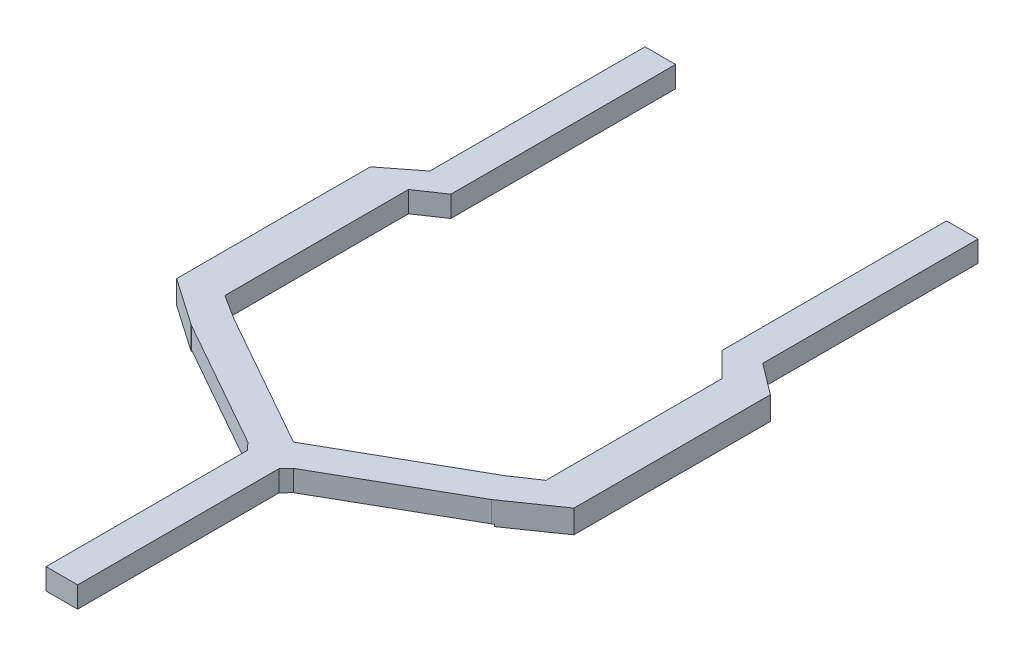
ISO-10303-21;
HEADER;
FILE_DESCRIPTION(('STEP AP214'),'2;1');
FILE_NAME('part.step','',(''),(''),'','','');
FILE_SCHEMA(('AUTOMOTIVE_DESIGN { 1 0 10303 214 1 1 1 1 }'));
ENDSEC;
DATA;
#1=APPLICATION_CONTEXT('core data for automotive mechanical design processes');
#2=APPLICATION_PROTOCOL_DEFINITION('international standard','automotive_design',2000,#1);
#3=PRODUCT_CONTEXT('',#1,'mechanical');
#4=PRODUCT('Part','Part','',(#3));
#5=PRODUCT_RELATED_PRODUCT_CATEGORY('part','',(#4));
#6=PRODUCT_DEFINITION_FORMATION('','',#4);
#7=PRODUCT_DEFINITION_CONTEXT('part definition',#1,'design');
#8=PRODUCT_DEFINITION('design','',#6,#7);
#9=PRODUCT_DEFINITION_SHAPE('','',#8);
#10=(LENGTH_UNIT() NAMED_UNIT(*) SI_UNIT(.MILLI.,.METRE.));
#11=(NAMED_UNIT(*) PLANE_ANGLE_UNIT() SI_UNIT($,.RADIAN.));
#12=(NAMED_UNIT(*) SI_UNIT($,.STERADIAN.) SOLID_ANGLE_UNIT());
#13=UNCERTAINTY_MEASURE_WITH_UNIT(LENGTH_MEASURE(1.E-05),#10,'distance_accuracy_value','');
#14=(GEOMETRIC_REPRESENTATION_CONTEXT(3) GLOBAL_UNCERTAINTY_ASSIGNED_CONTEXT((#13)) GLOBAL_UNIT_ASSIGNED_CONTEXT((#10,
#11,#12)) REPRESENTATION_CONTEXT('',''));
#15=CARTESIAN_POINT('',(0.,0.,0.));
#16=DIRECTION('',(0.,0.,1.));
#17=DIRECTION('',(1.,0.,0.));
#18=AXIS2_PLACEMENT_3D('',#15,#16,#17);
#19=CARTESIAN_POINT('',(20.066,2.54,0.));
#20=DIRECTION('',(1.,0.,0.));
#21=DIRECTION('',(0.,0.,-1.));
#22=AXIS2_PLACEMENT_3D('',#19,#20,#21);
#23=PLANE('',#22);
#24=DIRECTION('',(0.,0.,1.));
#25=VECTOR('',#24,1.);
#26=CARTESIAN_POINT('',(20.066,2.54,0.));
#27=LINE('',#26,#25);
#28=CARTESIAN_POINT('',(20.066,2.54,-90.3578767457702));
#29=VERTEX_POINT('',#28);
#30=CARTESIAN_POINT('',(20.066,2.54,-64.4164306863508));
#31=VERTEX_POINT('',#30);
#32=EDGE_CURVE('E329',#29,#31,#27,.T.);
#33=ORIENTED_EDGE('',*,*,#32,.T.);
#34=DIRECTION('',(0.,1.,0.));
#35=VECTOR('',#34,1.);
#36=CARTESIAN_POINT('',(20.066,-0.254000000000001,-64.4164306863508));
#37=LINE('',#36,#35);
#38=CARTESIAN_POINT('',(20.066,0.,-64.4164306863508));
#39=VERTEX_POINT('',#38);
#40=EDGE_CURVE('E276',#39,#31,#37,.T.);
#41=ORIENTED_EDGE('',*,*,#40,.F.);
#42=DIRECTION('',(0.,0.,1.));
#43=VECTOR('',#42,1.);
#44=CARTESIAN_POINT('',(20.066,0.,0.));
#45=LINE('',#44,#43);
#46=CARTESIAN_POINT('',(20.066,0.,-90.3578767457702));
#47=VERTEX_POINT('',#46);
#48=EDGE_CURVE('E375',#47,#39,#45,.T.);
#49=ORIENTED_EDGE('',*,*,#48,.F.);
#50=DIRECTION('',(0.,-1.,0.));
#51=VECTOR('',#50,1.);
#52=CARTESIAN_POINT('',(20.066,2.54,-90.3578767457702));
#53=LINE('',#52,#51);
#54=EDGE_CURVE('E418',#29,#47,#53,.T.);
#55=ORIENTED_EDGE('',*,*,#54,.F.);
#56=EDGE_LOOP('',(#33,#41,#49,#55));
#57=FACE_BOUND('',#56,.T.);
#58=ADVANCED_FACE('F35',(#57),#23,.T.);
#59=CARTESIAN_POINT('',(-0.137151710877593,2.54,0.073424146501728));
#60=DIRECTION('',(0.881613677056408,0.,-0.471971741131903));
#61=DIRECTION('',(-0.471971741131903,0.,-0.881613677056408));
#62=AXIS2_PLACEMENT_3D('',#59,#60,#61);
#63=PLANE('',#62);
#64=DIRECTION('',(0.,1.,0.));
#65=VECTOR('',#64,1.);
#66=CARTESIAN_POINT('',(-18.3853046553877,-0.254000000000001,-34.012983608155));
#67=LINE('',#66,#65);
#68=CARTESIAN_POINT('',(-18.3853046553877,0.,-34.012983608155));
#69=VERTEX_POINT('',#68);
#70=CARTESIAN_POINT('',(-18.3853046553877,2.54,-34.012983608155));
#71=VERTEX_POINT('',#70);
#72=EDGE_CURVE('E293',#69,#71,#67,.T.);
#73=ORIENTED_EDGE('',*,*,#72,.F.);
#74=DIRECTION('',(0.471971741131903,0.,0.881613677056408));
#75=VECTOR('',#74,1.);
#76=CARTESIAN_POINT('',(-0.137151710877593,0.,0.073424146501728));
#77=LINE('',#76,#75);
#78=CARTESIAN_POINT('',(-18.3592347962972,0.,-33.9642867427918));
#79=VERTEX_POINT('',#78);
#80=EDGE_CURVE('E399',#69,#79,#77,.T.);
#81=ORIENTED_EDGE('',*,*,#80,.T.);
#82=DIRECTION('',(0.,-1.,0.));
#83=VECTOR('',#82,1.);
#84=CARTESIAN_POINT('',(-18.3592347962972,2.54,-33.9642867427918));
#85=LINE('',#84,#83);
#86=CARTESIAN_POINT('',(-18.3592347962972,2.54,-33.9642867427918));
#87=VERTEX_POINT('',#86);
#88=EDGE_CURVE('E353',#87,#79,#85,.T.);
#89=ORIENTED_EDGE('',*,*,#88,.F.);
#90=DIRECTION('',(0.471971741131903,0.,0.881613677056408));
#91=VECTOR('',#90,1.);
#92=CARTESIAN_POINT('',(-0.137151710877593,2.54,0.073424146501728));
#93=LINE('',#92,#91);
#94=EDGE_CURVE('E351',#71,#87,#93,.T.);
#95=ORIENTED_EDGE('',*,*,#94,.F.);
#96=EDGE_LOOP('',(#73,#81,#89,#95));
#97=FACE_BOUND('',#96,.T.);
#98=ADVANCED_FACE('F546',(#97),#63,.F.);
#99=CARTESIAN_POINT('',(10.1014604239502,2.54,-17.9300922525116));
#100=DIRECTION('',(0.490843733940776,0.,-0.871247627744878));
#101=DIRECTION('',(-0.871247627744878,0.,-0.490843733940776));
#102=AXIS2_PLACEMENT_3D('',#99,#100,#101);
#103=PLANE('',#102);
#104=DIRECTION('',(0.871247627744878,0.,0.490843733940776));
#105=VECTOR('',#104,1.);
#106=CARTESIAN_POINT('',(10.1014604239502,0.,-17.9300922525116));
#107=LINE('',#106,#105);
#108=CARTESIAN_POINT('',(-2.74838844255943,0.,-25.1694437266015));
#109=VERTEX_POINT('',#108);
#110=EDGE_CURVE('E302',#79,#109,#107,.T.);
#111=ORIENTED_EDGE('',*,*,#110,.T.);
#112=DIRECTION('',(0.,-1.,0.));
#113=VECTOR('',#112,1.);
#114=CARTESIAN_POINT('',(-2.74838844255943,2.54,-25.1694437266015));
#115=LINE('',#114,#113);
#116=CARTESIAN_POINT('',(-2.74838844255943,2.54,-25.1694437266015));
#117=VERTEX_POINT('',#116);
#118=EDGE_CURVE('E432',#117,#109,#115,.T.);
#119=ORIENTED_EDGE('',*,*,#118,.F.);
#120=DIRECTION('',(0.871247627744878,0.,0.490843733940776));
#121=VECTOR('',#120,1.);
#122=CARTESIAN_POINT('',(10.1014604239502,2.54,-17.9300922525116));
#123=LINE('',#122,#121);
#124=EDGE_CURVE('E310',#87,#117,#123,.T.);
#125=ORIENTED_EDGE('',*,*,#124,.F.);
#126=ORIENTED_EDGE('',*,*,#88,.T.);
#127=EDGE_LOOP('',(#111,#119,#125,#126));
#128=FACE_BOUND('',#127,.T.);
#129=ADVANCED_FACE('F37',(#128),#103,.F.);
#130=CARTESIAN_POINT('',(11.1419283860614,2.54,-10.6846405459769));
#131=DIRECTION('',(0.721762966631555,0.,-0.69214031814309));
#132=DIRECTION('',(-0.69214031814309,0.,-0.721762966631555));
#133=AXIS2_PLACEMENT_3D('',#130,#131,#132);
#134=PLANE('',#133);
#135=DIRECTION('',(0.69214031814309,0.,0.721762966631555));
#136=VECTOR('',#135,1.);
#137=CARTESIAN_POINT('',(11.1419283860614,0.,-10.6846405459769));
#138=LINE('',#137,#136);
#139=CARTESIAN_POINT('',(-1.905,0.,-24.2899594249825));
#140=VERTEX_POINT('',#139);
#141=EDGE_CURVE('E356',#109,#140,#138,.T.);
#142=ORIENTED_EDGE('',*,*,#141,.T.);
#143=DIRECTION('',(0.,-1.,0.));
#144=VECTOR('',#143,1.);
#145=CARTESIAN_POINT('',(-1.905,2.54,-24.2899594249825));
#146=LINE('',#145,#144);
#147=CARTESIAN_POINT('',(-1.905,2.54,-24.2899594249825));
#148=VERTEX_POINT('',#147);
#149=EDGE_CURVE('E430',#148,#140,#146,.T.);
#150=ORIENTED_EDGE('',*,*,#149,.F.);
#151=DIRECTION('',(0.69214031814309,0.,0.721762966631555));
#152=VECTOR('',#151,1.);
#153=CARTESIAN_POINT('',(11.1419283860614,2.54,-10.6846405459769));
#154=LINE('',#153,#152);
#155=EDGE_CURVE('E313',#117,#148,#154,.T.);
#156=ORIENTED_EDGE('',*,*,#155,.F.);
#157=ORIENTED_EDGE('',*,*,#118,.T.);
#158=EDGE_LOOP('',(#142,#150,#156,#157));
#159=FACE_BOUND('',#158,.T.);
#160=ADVANCED_FACE('F660',(#159),#134,.F.);
#161=CARTESIAN_POINT('',(-1.905,2.54,0.));
#162=DIRECTION('',(-1.,0.,0.));
#163=DIRECTION('',(0.,0.,1.));
#164=AXIS2_PLACEMENT_3D('',#161,#162,#163);
#165=PLANE('',#164);
#166=DIRECTION('',(0.,0.,-1.));
#167=VECTOR('',#166,1.);
#168=CARTESIAN_POINT('',(-1.905,0.,0.));
#169=LINE('',#168,#167);
#170=CARTESIAN_POINT('',(-1.905,0.,0.));
#171=VERTEX_POINT('',#170);
#172=EDGE_CURVE('E359',#171,#140,#169,.T.);
#173=ORIENTED_EDGE('',*,*,#172,.F.);
#174=DIRECTION('',(0.,-1.,0.));
#175=VECTOR('',#174,1.);
#176=CARTESIAN_POINT('',(-1.905,2.54,0.));
#177=LINE('',#176,#175);
#178=CARTESIAN_POINT('',(-1.905,2.54,0.));
#179=VERTEX_POINT('',#178);
#180=EDGE_CURVE('E428',#179,#171,#177,.T.);
#181=ORIENTED_EDGE('',*,*,#180,.F.);
#182=DIRECTION('',(0.,0.,-1.));
#183=VECTOR('',#182,1.);
#184=CARTESIAN_POINT('',(-1.905,2.54,0.));
#185=LINE('',#184,#183);
#186=EDGE_CURVE('E316',#179,#148,#185,.T.);
#187=ORIENTED_EDGE('',*,*,#186,.T.);
#188=ORIENTED_EDGE('',*,*,#149,.T.);
#189=EDGE_LOOP('',(#173,#181,#187,#188));
#190=FACE_BOUND('',#189,.T.);
#191=ADVANCED_FACE('F657',(#190),#165,.T.);
#192=CARTESIAN_POINT('',(0.,2.54,0.));
#193=DIRECTION('',(0.,0.,1.));
#194=DIRECTION('',(1.,0.,0.));
#195=AXIS2_PLACEMENT_3D('',#192,#193,#194);
#196=PLANE('',#195);
#197=DIRECTION('',(-1.,0.,0.));
#198=VECTOR('',#197,1.);
#199=CARTESIAN_POINT('',(0.,0.,0.));
#200=LINE('',#199,#198);
#201=CARTESIAN_POINT('',(1.905,0.,0.));
#202=VERTEX_POINT('',#201);
#203=EDGE_CURVE('E362',#202,#171,#200,.T.);
#204=ORIENTED_EDGE('',*,*,#203,.F.);
#205=DIRECTION('',(0.,-1.,0.));
#206=VECTOR('',#205,1.);
#207=CARTESIAN_POINT('',(1.905,2.54,0.));
#208=LINE('',#207,#206);
#209=CARTESIAN_POINT('',(1.905,2.54,0.));
#210=VERTEX_POINT('',#209);
#211=EDGE_CURVE('E426',#210,#202,#208,.T.);
#212=ORIENTED_EDGE('',*,*,#211,.F.);
#213=DIRECTION('',(-1.,0.,0.));
#214=VECTOR('',#213,1.);
#215=CARTESIAN_POINT('',(0.,2.54,0.));
#216=LINE('',#215,#214);
#217=EDGE_CURVE('E319',#210,#179,#216,.T.);
#218=ORIENTED_EDGE('',*,*,#217,.T.);
#219=ORIENTED_EDGE('',*,*,#180,.T.);
#220=EDGE_LOOP('',(#204,#212,#218,#219));
#221=FACE_BOUND('',#220,.T.);
#222=ADVANCED_FACE('F653',(#221),#196,.T.);
#223=CARTESIAN_POINT('',(1.905,2.54,0.));
#224=DIRECTION('',(-1.,0.,0.));
#225=DIRECTION('',(0.,0.,1.));
#226=AXIS2_PLACEMENT_3D('',#223,#224,#225);
#227=PLANE('',#226);
#228=DIRECTION('',(0.,0.,-1.));
#229=VECTOR('',#228,1.);
#230=CARTESIAN_POINT('',(1.905,0.,0.));
#231=LINE('',#230,#229);
#232=CARTESIAN_POINT('',(1.905,0.,-24.2899594249825));
#233=VERTEX_POINT('',#232);
#234=EDGE_CURVE('E365',#202,#233,#231,.T.);
#235=ORIENTED_EDGE('',*,*,#234,.T.);
#236=DIRECTION('',(0.,-1.,0.));
#237=VECTOR('',#236,1.);
#238=CARTESIAN_POINT('',(1.905,2.54,-24.2899594249825));
#239=LINE('',#238,#237);
#240=CARTESIAN_POINT('',(1.905,2.54,-24.2899594249825));
#241=VERTEX_POINT('',#240);
#242=EDGE_CURVE('E423',#241,#233,#239,.T.);
#243=ORIENTED_EDGE('',*,*,#242,.F.);
#244=DIRECTION('',(0.,0.,-1.));
#245=VECTOR('',#244,1.);
#246=CARTESIAN_POINT('',(1.905,2.54,0.));
#247=LINE('',#246,#245);
#248=EDGE_CURVE('E322',#210,#241,#247,.T.);
#249=ORIENTED_EDGE('',*,*,#248,.F.);
#250=ORIENTED_EDGE('',*,*,#211,.T.);
#251=EDGE_LOOP('',(#235,#243,#249,#250));
#252=FACE_BOUND('',#251,.T.);
#253=ADVANCED_FACE('F650',(#252),#227,.F.);
#254=CARTESIAN_POINT('',(-11.1419283860616,2.54,-10.6846405459784));
#255=DIRECTION('',(-0.721762966631511,0.,-0.692140318143136));
#256=DIRECTION('',(-0.692140318143136,0.,0.721762966631511));
#257=AXIS2_PLACEMENT_3D('',#254,#255,#256);
#258=PLANE('',#257);
#259=DIRECTION('',(0.692140318143136,0.,-0.721762966631511));
#260=VECTOR('',#259,1.);
#261=CARTESIAN_POINT('',(-11.1419283860616,0.,-10.6846405459784));
#262=LINE('',#261,#260);
#263=CARTESIAN_POINT('',(2.74838844255953,0.,-25.1694437266015));
#264=VERTEX_POINT('',#263);
#265=EDGE_CURVE('E367',#233,#264,#262,.T.);
#266=ORIENTED_EDGE('',*,*,#265,.T.);
#267=DIRECTION('',(0.,-1.,0.));
#268=VECTOR('',#267,1.);
#269=CARTESIAN_POINT('',(2.74838844255953,2.54,-25.1694437266015));
#270=LINE('',#269,#268);
#271=CARTESIAN_POINT('',(2.74838844255953,2.54,-25.1694437266015));
#272=VERTEX_POINT('',#271);
#273=EDGE_CURVE('E420',#272,#264,#270,.T.);
#274=ORIENTED_EDGE('',*,*,#273,.F.);
#275=DIRECTION('',(0.692140318143136,0.,-0.721762966631511));
#276=VECTOR('',#275,1.);
#277=CARTESIAN_POINT('',(-11.1419283860616,2.54,-10.6846405459784));
#278=LINE('',#277,#276);
#279=EDGE_CURVE('E324',#241,#272,#278,.T.);
#280=ORIENTED_EDGE('',*,*,#279,.F.);
#281=ORIENTED_EDGE('',*,*,#242,.T.);
#282=EDGE_LOOP('',(#266,#274,#280,#281));
#283=FACE_BOUND('',#282,.T.);
#284=ADVANCED_FACE('F522',(#283),#258,.F.);
#285=CARTESIAN_POINT('',(-10.1656955271368,2.54,-17.7899671724893));
#286=DIRECTION('',(0.496138938356834,0.,0.868243142124459));
#287=DIRECTION('',(0.868243142124459,0.,-0.496138938356834));
#288=AXIS2_PLACEMENT_3D('',#285,#286,#287);
#289=PLANE('',#288);
#290=DIRECTION('',(0.,1.,0.));
#291=VECTOR('',#290,1.);
#292=CARTESIAN_POINT('',(17.9469765299134,-0.254000000000001,-33.8543512050894));
#293=LINE('',#292,#291);
#294=CARTESIAN_POINT('',(17.9469765299134,0.,-33.8543512050894));
#295=VERTEX_POINT('',#294);
#296=CARTESIAN_POINT('',(17.9469765299134,2.54,-33.8543512050894));
#297=VERTEX_POINT('',#296);
#298=EDGE_CURVE('E278',#295,#297,#293,.T.);
#299=ORIENTED_EDGE('',*,*,#298,.T.);
#300=DIRECTION('',(-0.868243142124459,0.,0.496138938356834));
#301=VECTOR('',#300,1.);
#302=CARTESIAN_POINT('',(-10.1656955271368,2.54,-17.7899671724893));
#303=LINE('',#302,#301);
#304=EDGE_CURVE('E327',#297,#272,#303,.T.);
#305=ORIENTED_EDGE('',*,*,#304,.T.);
#306=ORIENTED_EDGE('',*,*,#273,.T.);
#307=DIRECTION('',(-0.868243142124459,0.,0.496138938356834));
#308=VECTOR('',#307,1.);
#309=CARTESIAN_POINT('',(-10.1656955271368,0.,-17.7899671724893));
#310=LINE('',#309,#308);
#311=EDGE_CURVE('E370',#295,#264,#310,.T.);
#312=ORIENTED_EDGE('',*,*,#311,.F.);
#313=EDGE_LOOP('',(#299,#305,#306,#312));
#314=FACE_BOUND('',#313,.T.);
#315=ADVANCED_FACE('F510',(#314),#289,.T.);
#316=CARTESIAN_POINT('',(0.,2.54,-90.3578767457702));
#317=DIRECTION('',(0.,0.,-1.));
#318=DIRECTION('',(-1.,0.,0.));
#319=AXIS2_PLACEMENT_3D('',#316,#317,#318);
#320=PLANE('',#319);
#321=DIRECTION('',(1.,0.,0.));
#322=VECTOR('',#321,1.);
#323=CARTESIAN_POINT('',(0.,0.,-90.3578767457702));
#324=LINE('',#323,#322);
#325=CARTESIAN_POINT('',(16.2704595799521,0.,-90.3578767457702));
#326=VERTEX_POINT('',#325);
#327=EDGE_CURVE('E378',#326,#47,#324,.T.);
#328=ORIENTED_EDGE('',*,*,#327,.F.);
#329=DIRECTION('',(0.,-1.,0.));
#330=VECTOR('',#329,1.);
#331=CARTESIAN_POINT('',(16.2704595799521,2.54,-90.3578767457702));
#332=LINE('',#331,#330);
#333=CARTESIAN_POINT('',(16.2704595799521,2.54,-90.3578767457702));
#334=VERTEX_POINT('',#333);
#335=EDGE_CURVE('E416',#334,#326,#332,.T.);
#336=ORIENTED_EDGE('',*,*,#335,.F.);
#337=DIRECTION('',(1.,0.,0.));
#338=VECTOR('',#337,1.);
#339=CARTESIAN_POINT('',(0.,2.54,-90.3578767457702));
#340=LINE('',#339,#338);
#341=EDGE_CURVE('E332',#334,#29,#340,.T.);
#342=ORIENTED_EDGE('',*,*,#341,.T.);
#343=ORIENTED_EDGE('',*,*,#54,.T.);
#344=EDGE_LOOP('',(#328,#336,#342,#343));
#345=FACE_BOUND('',#344,.T.);
#346=ADVANCED_FACE('F612',(#345),#320,.T.);
#347=CARTESIAN_POINT('',(16.2704595799521,2.54,0.));
#348=DIRECTION('',(1.,0.,0.));
#349=DIRECTION('',(0.,0.,-1.));
#350=AXIS2_PLACEMENT_3D('',#347,#348,#349);
#351=PLANE('',#350);
#352=DIRECTION('',(0.,0.,1.));
#353=VECTOR('',#352,1.);
#354=CARTESIAN_POINT('',(16.2704595799521,0.,0.));
#355=LINE('',#354,#353);
#356=CARTESIAN_POINT('',(16.2704595799521,0.,-63.2891356107421));
#357=VERTEX_POINT('',#356);
#358=EDGE_CURVE('E381',#326,#357,#355,.T.);
#359=ORIENTED_EDGE('',*,*,#358,.T.);
#360=DIRECTION('',(0.,1.,0.));
#361=VECTOR('',#360,1.);
#362=CARTESIAN_POINT('',(16.2704595799521,2.54,-63.2891356107421));
#363=LINE('',#362,#361);
#364=CARTESIAN_POINT('',(16.2704595799521,2.54,-63.2891356107421));
#365=VERTEX_POINT('',#364);
#366=EDGE_CURVE('E484',#357,#365,#363,.T.);
#367=ORIENTED_EDGE('',*,*,#366,.T.);
#368=DIRECTION('',(0.,0.,1.));
#369=VECTOR('',#368,1.);
#370=CARTESIAN_POINT('',(16.2704595799521,2.54,0.));
#371=LINE('',#370,#369);
#372=EDGE_CURVE('E335',#334,#365,#371,.T.);
#373=ORIENTED_EDGE('',*,*,#372,.F.);
#374=ORIENTED_EDGE('',*,*,#335,.T.);
#375=EDGE_LOOP('',(#359,#367,#373,#374));
#376=FACE_BOUND('',#375,.T.);
#377=ADVANCED_FACE('F608',(#376),#351,.F.);
#378=CARTESIAN_POINT('',(-11.9846163510707,2.54,-21.1157526185533));
#379=DIRECTION('',(0.493605519458381,0.,0.869685915236197));
#380=DIRECTION('',(0.869685915236197,0.,-0.493605519458381));
#381=AXIS2_PLACEMENT_3D('',#378,#379,#380);
#382=PLANE('',#381);
#383=DIRECTION('',(-0.869685915236197,0.,0.493605519458381));
#384=VECTOR('',#383,1.);
#385=CARTESIAN_POINT('',(-11.9846163510707,0.,-21.1157526185533));
#386=LINE('',#385,#384);
#387=CARTESIAN_POINT('',(16.2704595799521,0.,-37.1524173361608));
#388=VERTEX_POINT('',#387);
#389=CARTESIAN_POINT('',(0.,0.,-27.917832169161));
#390=VERTEX_POINT('',#389);
#391=EDGE_CURVE('E384',#388,#390,#386,.T.);
#392=ORIENTED_EDGE('',*,*,#391,.T.);
#393=DIRECTION('',(0.,-1.,0.));
#394=VECTOR('',#393,1.);
#395=CARTESIAN_POINT('',(0.,2.54,-27.917832169161));
#396=LINE('',#395,#394);
#397=CARTESIAN_POINT('',(0.,2.54,-27.917832169161));
#398=VERTEX_POINT('',#397);
#399=EDGE_CURVE('E411',#398,#390,#396,.T.);
#400=ORIENTED_EDGE('',*,*,#399,.F.);
#401=DIRECTION('',(-0.869685915236197,0.,0.493605519458381));
#402=VECTOR('',#401,1.);
#403=CARTESIAN_POINT('',(-11.9846163510707,2.54,-21.1157526185533));
#404=LINE('',#403,#402);
#405=CARTESIAN_POINT('',(16.2704595799521,2.54,-37.1524173361608));
#406=VERTEX_POINT('',#405);
#407=EDGE_CURVE('E338',#406,#398,#404,.T.);
#408=ORIENTED_EDGE('',*,*,#407,.F.);
#409=DIRECTION('',(0.,-1.,0.));
#410=VECTOR('',#409,1.);
#411=CARTESIAN_POINT('',(16.2704595799521,2.54,-37.1524173361608));
#412=LINE('',#411,#410);
#413=EDGE_CURVE('E413',#406,#388,#412,.T.);
#414=ORIENTED_EDGE('',*,*,#413,.T.);
#415=EDGE_LOOP('',(#392,#400,#408,#414));
#416=FACE_BOUND('',#415,.T.);
#417=ADVANCED_FACE('F593',(#416),#382,.F.);
#418=CARTESIAN_POINT('',(11.9431106206795,2.54,-21.1848033628718));
#419=DIRECTION('',(0.491093730974849,0.,-0.871106737086336));
#420=DIRECTION('',(-0.871106737086336,0.,-0.491093730974849));
#421=AXIS2_PLACEMENT_3D('',#418,#419,#420);
#422=PLANE('',#421);
#423=DIRECTION('',(0.871106737086336,0.,0.491093730974849));
#424=VECTOR('',#423,1.);
#425=CARTESIAN_POINT('',(11.9431106206795,0.,-21.1848033628718));
#426=LINE('',#425,#424);
#427=CARTESIAN_POINT('',(-16.3803951176544,0.,-37.1524173361608));
#428=VERTEX_POINT('',#427);
#429=EDGE_CURVE('E387',#428,#390,#426,.T.);
#430=ORIENTED_EDGE('',*,*,#429,.F.);
#431=DIRECTION('',(0.,-1.,0.));
#432=VECTOR('',#431,1.);
#433=CARTESIAN_POINT('',(-16.3803951176544,2.54,-37.1524173361608));
#434=LINE('',#433,#432);
#435=CARTESIAN_POINT('',(-16.3803951176544,2.54,-37.1524173361608));
#436=VERTEX_POINT('',#435);
#437=EDGE_CURVE('E409',#436,#428,#434,.T.);
#438=ORIENTED_EDGE('',*,*,#437,.F.);
#439=DIRECTION('',(0.871106737086336,0.,0.491093730974849));
#440=VECTOR('',#439,1.);
#441=CARTESIAN_POINT('',(11.9431106206795,2.54,-21.1848033628718));
#442=LINE('',#441,#440);
#443=EDGE_CURVE('E340',#436,#398,#442,.T.);
#444=ORIENTED_EDGE('',*,*,#443,.T.);
#445=ORIENTED_EDGE('',*,*,#399,.T.);
#446=EDGE_LOOP('',(#430,#438,#444,#445));
#447=FACE_BOUND('',#446,.T.);
#448=ADVANCED_FACE('F589',(#447),#422,.T.);
#449=CARTESIAN_POINT('',(-16.3803951176544,2.54,0.));
#450=DIRECTION('',(1.,0.,0.));
#451=DIRECTION('',(0.,0.,-1.));
#452=AXIS2_PLACEMENT_3D('',#449,#450,#451);
#453=PLANE('',#452);
#454=DIRECTION('',(0.,1.,0.));
#455=VECTOR('',#454,1.);
#456=CARTESIAN_POINT('',(-16.3803951176544,-0.254000000000001,-63.274089715642));
#457=LINE('',#456,#455);
#458=CARTESIAN_POINT('',(-16.3803951176544,0.,-63.274089715642));
#459=VERTEX_POINT('',#458);
#460=CARTESIAN_POINT('',(-16.3803951176544,2.54,-63.274089715642));
#461=VERTEX_POINT('',#460);
#462=EDGE_CURVE('E496',#459,#461,#457,.T.);
#463=ORIENTED_EDGE('',*,*,#462,.F.);
#464=DIRECTION('',(0.,0.,1.));
#465=VECTOR('',#464,1.);
#466=CARTESIAN_POINT('',(-16.3803951176544,0.,0.));
#467=LINE('',#466,#465);
#468=CARTESIAN_POINT('',(-16.3803951176544,0.,-90.3578767457702));
#469=VERTEX_POINT('',#468);
#470=EDGE_CURVE('E390',#469,#459,#467,.T.);
#471=ORIENTED_EDGE('',*,*,#470,.F.);
#472=DIRECTION('',(0.,-1.,0.));
#473=VECTOR('',#472,1.);
#474=CARTESIAN_POINT('',(-16.3803951176544,2.54,-90.3578767457702));
#475=LINE('',#474,#473);
#476=CARTESIAN_POINT('',(-16.3803951176544,2.54,-90.3578767457702));
#477=VERTEX_POINT('',#476);
#478=EDGE_CURVE('E407',#477,#469,#475,.T.);
#479=ORIENTED_EDGE('',*,*,#478,.F.);
#480=DIRECTION('',(0.,0.,1.));
#481=VECTOR('',#480,1.);
#482=CARTESIAN_POINT('',(-16.3803951176544,2.54,0.));
#483=LINE('',#482,#481);
#484=EDGE_CURVE('E343',#477,#461,#483,.T.);
#485=ORIENTED_EDGE('',*,*,#484,.T.);
#486=EDGE_LOOP('',(#463,#471,#479,#485));
#487=FACE_BOUND('',#486,.T.);
#488=ADVANCED_FACE('F574',(#487),#453,.T.);
#489=CARTESIAN_POINT('',(0.,2.54,-90.3578767457702));
#490=DIRECTION('',(0.,0.,1.));
#491=DIRECTION('',(1.,0.,0.));
#492=AXIS2_PLACEMENT_3D('',#489,#490,#491);
#493=PLANE('',#492);
#494=DIRECTION('',(-1.,0.,0.));
#495=VECTOR('',#494,1.);
#496=CARTESIAN_POINT('',(0.,0.,-90.3578767457702));
#497=LINE('',#496,#495);
#498=CARTESIAN_POINT('',(-20.0659999999999,0.,-90.3578767457702));
#499=VERTEX_POINT('',#498);
#500=EDGE_CURVE('E393',#469,#499,#497,.T.);
#501=ORIENTED_EDGE('',*,*,#500,.T.);
#502=DIRECTION('',(0.,-1.,0.));
#503=VECTOR('',#502,1.);
#504=CARTESIAN_POINT('',(-20.0659999999999,2.54,-90.3578767457702));
#505=LINE('',#504,#503);
#506=CARTESIAN_POINT('',(-20.0659999999999,2.54,-90.3578767457702));
#507=VERTEX_POINT('',#506);
#508=EDGE_CURVE('E404',#507,#499,#505,.T.);
#509=ORIENTED_EDGE('',*,*,#508,.F.);
#510=DIRECTION('',(-1.,0.,0.));
#511=VECTOR('',#510,1.);
#512=CARTESIAN_POINT('',(0.,2.54,-90.3578767457702));
#513=LINE('',#512,#511);
#514=EDGE_CURVE('E346',#477,#507,#513,.T.);
#515=ORIENTED_EDGE('',*,*,#514,.F.);
#516=ORIENTED_EDGE('',*,*,#478,.T.);
#517=EDGE_LOOP('',(#501,#509,#515,#516));
#518=FACE_BOUND('',#517,.T.);
#519=ADVANCED_FACE('F569',(#518),#493,.F.);
#520=CARTESIAN_POINT('',(-20.0659999999999,2.54,0.));
#521=DIRECTION('',(1.,0.,0.));
#522=DIRECTION('',(0.,0.,-1.));
#523=AXIS2_PLACEMENT_3D('',#520,#521,#522);
#524=PLANE('',#523);
#525=DIRECTION('',(0.,0.,1.));
#526=VECTOR('',#525,1.);
#527=CARTESIAN_POINT('',(-20.0659999999999,0.,0.));
#528=LINE('',#527,#526);
#529=CARTESIAN_POINT('',(-20.0659999999999,0.,-64.4164306863508));
#530=VERTEX_POINT('',#529);
#531=EDGE_CURVE('E396',#499,#530,#528,.T.);
#532=ORIENTED_EDGE('',*,*,#531,.T.);
#533=DIRECTION('',(0.,1.,0.));
#534=VECTOR('',#533,1.);
#535=CARTESIAN_POINT('',(-20.0659999999999,-0.254000000000001,-64.4164306863508));
#536=LINE('',#535,#534);
#537=CARTESIAN_POINT('',(-20.0659999999999,2.54,-64.4164306863508));
#538=VERTEX_POINT('',#537);
#539=EDGE_CURVE('E303',#530,#538,#536,.T.);
#540=ORIENTED_EDGE('',*,*,#539,.T.);
#541=DIRECTION('',(0.,0.,1.));
#542=VECTOR('',#541,1.);
#543=CARTESIAN_POINT('',(-20.0659999999999,2.54,0.));
#544=LINE('',#543,#542);
#545=EDGE_CURVE('E348',#507,#538,#544,.T.);
#546=ORIENTED_EDGE('',*,*,#545,.F.);
#547=ORIENTED_EDGE('',*,*,#508,.T.);
#548=EDGE_LOOP('',(#532,#540,#546,#547));
#549=FACE_BOUND('',#548,.T.);
#550=ADVANCED_FACE('F563',(#549),#524,.F.);
#551=CARTESIAN_POINT('',(0.,2.54,0.));
#552=DIRECTION('',(0.,1.,0.));
#553=DIRECTION('',(0.,0.,1.));
#554=AXIS2_PLACEMENT_3D('',#551,#552,#553);
#555=PLANE('',#554);
#556=DIRECTION('',(-0.821076360113838,0.,0.570818369415536));
#557=VECTOR('',#556,1.);
#558=CARTESIAN_POINT('',(17.9469765299134,2.54,-33.8543512050894));
#559=LINE('',#558,#557);
#560=CARTESIAN_POINT('',(23.7979137303775,2.54,-37.9219661000775));
#561=VERTEX_POINT('',#560);
#562=EDGE_CURVE('E260',#561,#297,#559,.T.);
#563=ORIENTED_EDGE('',*,*,#562,.F.);
#564=DIRECTION('',(0.,0.,1.));
#565=VECTOR('',#564,1.);
#566=CARTESIAN_POINT('',(23.7979137303775,2.54,0.));
#567=LINE('',#566,#565);
#568=CARTESIAN_POINT('',(23.7979137303775,2.54,-61.6013045377534));
#569=VERTEX_POINT('',#568);
#570=EDGE_CURVE('E499',#569,#561,#567,.T.);
#571=ORIENTED_EDGE('',*,*,#570,.F.);
#572=DIRECTION('',(0.798334419333176,0.,0.602214376204987));
#573=VECTOR('',#572,1.);
#574=CARTESIAN_POINT('',(25.1668186608023,2.54,-60.5686868667675));
#575=LINE('',#574,#573);
#576=EDGE_CURVE('E617',#31,#569,#575,.T.);
#577=ORIENTED_EDGE('',*,*,#576,.F.);
#578=ORIENTED_EDGE('',*,*,#32,.F.);
#579=ORIENTED_EDGE('',*,*,#341,.F.);
#580=ORIENTED_EDGE('',*,*,#372,.T.);
#581=DIRECTION('',(-0.707106781186549,0.,-0.707106781186546));
#582=VECTOR('',#581,1.);
#583=CARTESIAN_POINT('',(19.2107793993315,2.54,-60.3488157913628));
#584=LINE('',#583,#582);
#585=CARTESIAN_POINT('',(19.2107793993315,2.54,-60.3488157913628));
#586=VERTEX_POINT('',#585);
#587=EDGE_CURVE('E479',#586,#365,#584,.T.);
#588=ORIENTED_EDGE('',*,*,#587,.F.);
#589=DIRECTION('',(0.,0.,-1.));
#590=VECTOR('',#589,1.);
#591=CARTESIAN_POINT('',(19.2107793993315,2.54,-39.1312570148036));
#592=LINE('',#591,#590);
#593=CARTESIAN_POINT('',(19.2107793993315,2.54,-39.1312570148036));
#594=VERTEX_POINT('',#593);
#595=EDGE_CURVE('E472',#594,#586,#592,.T.);
#596=ORIENTED_EDGE('',*,*,#595,.F.);
#597=DIRECTION('',(0.829616727470738,0.,-0.558333310398675));
#598=VECTOR('',#597,1.);
#599=CARTESIAN_POINT('',(16.2704595799521,2.54,-37.1524173361608));
#600=LINE('',#599,#598);
#601=EDGE_CURVE('E468',#406,#594,#600,.T.);
#602=ORIENTED_EDGE('',*,*,#601,.F.);
#603=ORIENTED_EDGE('',*,*,#407,.T.);
#604=ORIENTED_EDGE('',*,*,#443,.F.);
#605=DIRECTION('',(0.845017912644893,0.,0.534737998751975));
#606=VECTOR('',#605,1.);
#607=CARTESIAN_POINT('',(-16.3803951176544,2.54,-37.1524173361608));
#608=LINE('',#607,#606);
#609=CARTESIAN_POINT('',(-19.4252628213139,2.54,-39.0792480434805));
#610=VERTEX_POINT('',#609);
#611=EDGE_CURVE('E494',#610,#436,#608,.T.);
#612=ORIENTED_EDGE('',*,*,#611,.F.);
#613=DIRECTION('',(0.,0.,1.));
#614=VECTOR('',#613,1.);
#615=CARTESIAN_POINT('',(-19.4252628213139,2.54,-39.0792480434805));
#616=LINE('',#615,#614);
#617=CARTESIAN_POINT('',(-19.4252628213139,2.54,-61.216281016721));
#618=VERTEX_POINT('',#617);
#619=EDGE_CURVE('E491',#618,#610,#616,.T.);
#620=ORIENTED_EDGE('',*,*,#619,.F.);
#621=DIRECTION('',(-0.828530185204564,0.,0.559944400994322));
#622=VECTOR('',#621,1.);
#623=CARTESIAN_POINT('',(-19.4252628213139,2.54,-61.216281016721));
#624=LINE('',#623,#622);
#625=EDGE_CURVE('E488',#461,#618,#624,.T.);
#626=ORIENTED_EDGE('',*,*,#625,.F.);
#627=ORIENTED_EDGE('',*,*,#484,.F.);
#628=ORIENTED_EDGE('',*,*,#514,.T.);
#629=ORIENTED_EDGE('',*,*,#545,.T.);
#630=DIRECTION('',(0.788359831352413,0.,-0.615214414907514));
#631=VECTOR('',#630,1.);
#632=CARTESIAN_POINT('',(-25.9827794418144,2.54,-59.7991381028509));
#633=LINE('',#632,#631);
#634=CARTESIAN_POINT('',(-24.0937698938882,2.54,-61.2732694037677));
#635=VERTEX_POINT('',#634);
#636=EDGE_CURVE('E532',#635,#538,#633,.T.);
#637=ORIENTED_EDGE('',*,*,#636,.F.);
#638=DIRECTION('',(0.,0.,1.));
#639=VECTOR('',#638,1.);
#640=CARTESIAN_POINT('',(-24.0937698938882,2.54,0.));
#641=LINE('',#640,#639);
#642=CARTESIAN_POINT('',(-24.0937698938882,2.54,-37.933647844426));
#643=VERTEX_POINT('',#642);
#644=EDGE_CURVE('E294',#635,#643,#641,.T.);
#645=ORIENTED_EDGE('',*,*,#644,.T.);
#646=DIRECTION('',(-0.822239272628296,0.,-0.569141966953493));
#647=VECTOR('',#646,1.);
#648=CARTESIAN_POINT('',(-18.3592347962972,2.54,-33.9642867427918));
#649=LINE('',#648,#647);
#650=CARTESIAN_POINT('',(-18.4295871468185,2.54,-34.012983608155));
#651=VERTEX_POINT('',#650);
#652=EDGE_CURVE('E530',#651,#643,#649,.T.);
#653=ORIENTED_EDGE('',*,*,#652,.F.);
#654=DIRECTION('',(-1.,0.,0.));
#655=VECTOR('',#654,1.);
#656=CARTESIAN_POINT('',(0.,2.54,-34.012983608155));
#657=LINE('',#656,#655);
#658=EDGE_CURVE('E286',#71,#651,#657,.T.);
#659=ORIENTED_EDGE('',*,*,#658,.F.);
#660=ORIENTED_EDGE('',*,*,#94,.T.);
#661=ORIENTED_EDGE('',*,*,#124,.T.);
#662=ORIENTED_EDGE('',*,*,#155,.T.);
#663=ORIENTED_EDGE('',*,*,#186,.F.);
#664=ORIENTED_EDGE('',*,*,#217,.F.);
#665=ORIENTED_EDGE('',*,*,#248,.T.);
#666=ORIENTED_EDGE('',*,*,#279,.T.);
#667=ORIENTED_EDGE('',*,*,#304,.F.);
#668=EDGE_LOOP('',(#563,#571,#577,#578,#579,#580,#588,#596,#602,#603,#604,#612,#620,#626,#627,
#628,#629,#637,#645,#653,#659,#660,#661,#662,#663,#664,#665,#666,#667));
#669=FACE_BOUND('',#668,.T.);
#670=ADVANCED_FACE('F514',(#669),#555,.T.);
#671=CARTESIAN_POINT('',(0.,0.,0.));
#672=DIRECTION('',(0.,1.,0.));
#673=DIRECTION('',(0.,0.,1.));
#674=AXIS2_PLACEMENT_3D('',#671,#672,#673);
#675=PLANE('',#674);
#676=DIRECTION('',(-0.517208865247926,0.,0.855859211382896));
#677=VECTOR('',#676,1.);
#678=CARTESIAN_POINT('',(-1.7475692320106,0.,-1.05608292509925));
#679=LINE('',#678,#677);
#680=CARTESIAN_POINT('',(20.066,0.,-37.1524173361608));
#681=VERTEX_POINT('',#680);
#682=CARTESIAN_POINT('',(18.1641808441331,0.,-34.0053532537366));
#683=VERTEX_POINT('',#682);
#684=EDGE_CURVE('E372',#681,#683,#679,.T.);
#685=ORIENTED_EDGE('',*,*,#684,.T.);
#686=DIRECTION('',(-0.821076360113838,0.,0.570818369415536));
#687=VECTOR('',#686,1.);
#688=CARTESIAN_POINT('',(-10.0193143069984,0.,-14.4119785956608));
#689=LINE('',#688,#687);
#690=EDGE_CURVE('E528',#683,#295,#689,.T.);
#691=ORIENTED_EDGE('',*,*,#690,.T.);
#692=ORIENTED_EDGE('',*,*,#311,.T.);
#693=ORIENTED_EDGE('',*,*,#265,.F.);
#694=ORIENTED_EDGE('',*,*,#234,.F.);
#695=ORIENTED_EDGE('',*,*,#203,.T.);
#696=ORIENTED_EDGE('',*,*,#172,.T.);
#697=ORIENTED_EDGE('',*,*,#141,.F.);
#698=ORIENTED_EDGE('',*,*,#110,.F.);
#699=ORIENTED_EDGE('',*,*,#80,.F.);
#700=CARTESIAN_POINT('',(-20.0659999999999,0.,-37.1524173361608));
#701=VERTEX_POINT('',#700);
#702=EDGE_CURVE('E314',#701,#69,#77,.T.);
#703=ORIENTED_EDGE('',*,*,#702,.F.);
#704=EDGE_CURVE('E395',#530,#701,#528,.T.);
#705=ORIENTED_EDGE('',*,*,#704,.F.);
#706=ORIENTED_EDGE('',*,*,#531,.F.);
#707=ORIENTED_EDGE('',*,*,#500,.F.);
#708=ORIENTED_EDGE('',*,*,#470,.T.);
#709=DIRECTION('',(-0.828530185204564,0.,0.559944400994322));
#710=VECTOR('',#709,1.);
#711=CARTESIAN_POINT('',(-34.490673419731,0.,-51.0346455568356));
#712=LINE('',#711,#710);
#713=CARTESIAN_POINT('',(-19.4252628213139,0.,-61.216281016721));
#714=VERTEX_POINT('',#713);
#715=EDGE_CURVE('E435',#459,#714,#712,.T.);
#716=ORIENTED_EDGE('',*,*,#715,.T.);
#717=DIRECTION('',(0.,0.,1.));
#718=VECTOR('',#717,1.);
#719=CARTESIAN_POINT('',(-19.4252628213139,0.,0.));
#720=LINE('',#719,#718);
#721=CARTESIAN_POINT('',(-19.4252628213139,0.,-39.0792480434805));
#722=VERTEX_POINT('',#721);
#723=EDGE_CURVE('E438',#714,#722,#720,.T.);
#724=ORIENTED_EDGE('',*,*,#723,.T.);
#725=DIRECTION('',(0.845017912644893,0.,0.534737998751975));
#726=VECTOR('',#725,1.);
#727=CARTESIAN_POINT('',(12.1039221063549,0.,-19.127181941436));
#728=LINE('',#727,#726);
#729=EDGE_CURVE('E441',#722,#428,#728,.T.);
#730=ORIENTED_EDGE('',*,*,#729,.T.);
#731=ORIENTED_EDGE('',*,*,#429,.T.);
#732=ORIENTED_EDGE('',*,*,#391,.F.);
#733=DIRECTION('',(0.829616727470738,0.,-0.558333310398675));
#734=VECTOR('',#733,1.);
#735=CARTESIAN_POINT('',(-12.1370089268457,0.,-18.03414813274));
#736=LINE('',#735,#734);
#737=CARTESIAN_POINT('',(19.2107793993315,0.,-39.1312570148036));
#738=VERTEX_POINT('',#737);
#739=EDGE_CURVE('E444',#388,#738,#736,.T.);
#740=ORIENTED_EDGE('',*,*,#739,.T.);
#741=DIRECTION('',(0.,0.,-1.));
#742=VECTOR('',#741,1.);
#743=CARTESIAN_POINT('',(19.2107793993315,0.,0.));
#744=LINE('',#743,#742);
#745=CARTESIAN_POINT('',(19.2107793993315,0.,-60.3488157913628));
#746=VERTEX_POINT('',#745);
#747=EDGE_CURVE('E447',#738,#746,#744,.T.);
#748=ORIENTED_EDGE('',*,*,#747,.T.);
#749=DIRECTION('',(-0.707106781186549,0.,-0.707106781186546));
#750=VECTOR('',#749,1.);
#751=CARTESIAN_POINT('',(39.7797975953471,0.,-39.7797975953472));
#752=LINE('',#751,#750);
#753=EDGE_CURVE('E450',#746,#357,#752,.T.);
#754=ORIENTED_EDGE('',*,*,#753,.T.);
#755=ORIENTED_EDGE('',*,*,#358,.F.);
#756=ORIENTED_EDGE('',*,*,#327,.T.);
#757=ORIENTED_EDGE('',*,*,#48,.T.);
#758=EDGE_CURVE('E273',#39,#681,#45,.T.);
#759=ORIENTED_EDGE('',*,*,#758,.T.);
#760=EDGE_LOOP('',(#685,#691,#692,#693,#694,#695,#696,#697,#698,#699,#703,#705,#706,#707,#708,
#716,#724,#730,#731,#732,#740,#748,#754,#755,#756,#757,#759));
#761=FACE_BOUND('',#760,.T.);
#762=ADVANCED_FACE('F526',(#761),#675,.F.);
#763=CARTESIAN_POINT('',(-20.0659999999999,-0.254000000000001,0.));
#764=DIRECTION('',(-1.,0.,0.));
#765=DIRECTION('',(0.,0.,1.));
#766=AXIS2_PLACEMENT_3D('',#763,#764,#765);
#767=PLANE('',#766);
#768=CARTESIAN_POINT('',(-20.0659999999999,-0.254000000000001,-64.4164306863508));
#769=VERTEX_POINT('',#768);
#770=EDGE_CURVE('E299',#769,#530,#536,.T.);
#771=ORIENTED_EDGE('',*,*,#770,.T.);
#772=ORIENTED_EDGE('',*,*,#704,.T.);
#773=DIRECTION('',(0.,1.,0.));
#774=VECTOR('',#773,1.);
#775=CARTESIAN_POINT('',(-20.0659999999999,-0.254000000000001,-37.1524173361608));
#776=LINE('',#775,#774);
#777=CARTESIAN_POINT('',(-20.0659999999999,-0.254000000000001,-37.1524173361608));
#778=VERTEX_POINT('',#777);
#779=EDGE_CURVE('E304',#778,#701,#776,.T.);
#780=ORIENTED_EDGE('',*,*,#779,.F.);
#781=DIRECTION('',(0.,0.,1.));
#782=VECTOR('',#781,1.);
#783=CARTESIAN_POINT('',(-20.0659999999999,-0.254000000000001,0.));
#784=LINE('',#783,#782);
#785=EDGE_CURVE('E291',#769,#778,#784,.T.);
#786=ORIENTED_EDGE('',*,*,#785,.F.);
#787=EDGE_LOOP('',(#771,#772,#780,#786));
#788=FACE_BOUND('',#787,.T.);
#789=ADVANCED_FACE('F557',(#788),#767,.F.);
#790=CARTESIAN_POINT('',(-0.137151710877593,-0.254000000000001,0.073424146501728));
#791=DIRECTION('',(-0.881613677056408,0.,0.471971741131903));
#792=DIRECTION('',(0.471971741131903,0.,0.881613677056408));
#793=AXIS2_PLACEMENT_3D('',#790,#791,#792);
#794=PLANE('',#793);
#795=ORIENTED_EDGE('',*,*,#779,.T.);
#796=ORIENTED_EDGE('',*,*,#702,.T.);
#797=CARTESIAN_POINT('',(-18.3853046553877,-0.254000000000001,-34.012983608155));
#798=VERTEX_POINT('',#797);
#799=EDGE_CURVE('E307',#798,#69,#67,.T.);
#800=ORIENTED_EDGE('',*,*,#799,.F.);
#801=DIRECTION('',(0.471971741131903,0.,0.881613677056408));
#802=VECTOR('',#801,1.);
#803=CARTESIAN_POINT('',(-0.137151710877593,-0.254000000000001,0.073424146501728));
#804=LINE('',#803,#802);
#805=EDGE_CURVE('E289',#778,#798,#804,.T.);
#806=ORIENTED_EDGE('',*,*,#805,.F.);
#807=EDGE_LOOP('',(#795,#796,#800,#806));
#808=FACE_BOUND('',#807,.T.);
#809=ADVANCED_FACE('F549',(#808),#794,.F.);
#810=CARTESIAN_POINT('',(0.,-0.254000000000001,-34.012983608155));
#811=DIRECTION('',(0.,0.,-1.));
#812=DIRECTION('',(-1.,0.,0.));
#813=AXIS2_PLACEMENT_3D('',#810,#811,#812);
#814=PLANE('',#813);
#815=ORIENTED_EDGE('',*,*,#658,.T.);
#816=DIRECTION('',(0.,-1.,0.));
#817=VECTOR('',#816,1.);
#818=CARTESIAN_POINT('',(-18.4295871468185,-0.254000000000001,-34.012983608155));
#819=LINE('',#818,#817);
#820=CARTESIAN_POINT('',(-18.4295871468185,-0.254000000000001,-34.012983608155));
#821=VERTEX_POINT('',#820);
#822=EDGE_CURVE('E469',#651,#821,#819,.T.);
#823=ORIENTED_EDGE('',*,*,#822,.T.);
#824=DIRECTION('',(-1.,0.,0.));
#825=VECTOR('',#824,1.);
#826=CARTESIAN_POINT('',(0.,-0.254000000000001,-34.012983608155));
#827=LINE('',#826,#825);
#828=EDGE_CURVE('E285',#798,#821,#827,.T.);
#829=ORIENTED_EDGE('',*,*,#828,.F.);
#830=ORIENTED_EDGE('',*,*,#799,.T.);
#831=ORIENTED_EDGE('',*,*,#72,.T.);
#832=EDGE_LOOP('',(#815,#823,#829,#830,#831));
#833=FACE_BOUND('',#832,.T.);
#834=ADVANCED_FACE('F542',(#833),#814,.F.);
#835=CARTESIAN_POINT('',(-24.0937698938882,-0.254000000000001,0.));
#836=DIRECTION('',(-1.,0.,0.));
#837=DIRECTION('',(0.,0.,1.));
#838=AXIS2_PLACEMENT_3D('',#835,#836,#837);
#839=PLANE('',#838);
#840=DIRECTION('',(0.,1.,0.));
#841=VECTOR('',#840,1.);
#842=CARTESIAN_POINT('',(-24.0937698938882,-0.254000000000001,-61.2732694037677));
#843=LINE('',#842,#841);
#844=CARTESIAN_POINT('',(-24.0937698938882,-0.254000000000001,-61.2732694037677));
#845=VERTEX_POINT('',#844);
#846=EDGE_CURVE('E465',#845,#635,#843,.T.);
#847=ORIENTED_EDGE('',*,*,#846,.F.);
#848=DIRECTION('',(0.,0.,1.));
#849=VECTOR('',#848,1.);
#850=CARTESIAN_POINT('',(-24.0937698938882,-0.254000000000001,0.));
#851=LINE('',#850,#849);
#852=CARTESIAN_POINT('',(-24.0937698938882,-0.254000000000001,-37.933647844426));
#853=VERTEX_POINT('',#852);
#854=EDGE_CURVE('E282',#845,#853,#851,.T.);
#855=ORIENTED_EDGE('',*,*,#854,.T.);
#856=DIRECTION('',(0.,-1.,0.));
#857=VECTOR('',#856,1.);
#858=CARTESIAN_POINT('',(-24.0937698938882,-0.254000000000001,-37.933647844426));
#859=LINE('',#858,#857);
#860=EDGE_CURVE('E464',#643,#853,#859,.T.);
#861=ORIENTED_EDGE('',*,*,#860,.F.);
#862=ORIENTED_EDGE('',*,*,#644,.F.);
#863=EDGE_LOOP('',(#847,#855,#861,#862));
#864=FACE_BOUND('',#863,.T.);
#865=ADVANCED_FACE('F462',(#864),#839,.T.);
#866=CARTESIAN_POINT('',(0.,-0.254000000000001,0.));
#867=DIRECTION('',(0.,1.,0.));
#868=DIRECTION('',(0.,0.,1.));
#869=AXIS2_PLACEMENT_3D('',#866,#867,#868);
#870=PLANE('',#869);
#871=ORIENTED_EDGE('',*,*,#854,.F.);
#872=DIRECTION('',(0.788359831352413,0.,-0.615214414907514));
#873=VECTOR('',#872,1.);
#874=CARTESIAN_POINT('',(-38.8373902434893,-0.254000000000001,-49.7677519911947));
#875=LINE('',#874,#873);
#876=EDGE_CURVE('E11',#845,#769,#875,.T.);
#877=ORIENTED_EDGE('',*,*,#876,.T.);
#878=ORIENTED_EDGE('',*,*,#785,.T.);
#879=ORIENTED_EDGE('',*,*,#805,.T.);
#880=ORIENTED_EDGE('',*,*,#828,.T.);
#881=DIRECTION('',(-0.822239272628296,0.,-0.569141966953493));
#882=VECTOR('',#881,1.);
#883=CARTESIAN_POINT('',(9.9473263759498,-0.254000000000001,-14.3709001951451));
#884=LINE('',#883,#882);
#885=EDGE_CURVE('E43',#821,#853,#884,.T.);
#886=ORIENTED_EDGE('',*,*,#885,.T.);
#887=EDGE_LOOP('',(#871,#877,#878,#879,#880,#886));
#888=FACE_BOUND('',#887,.T.);
#889=ADVANCED_FACE('F455',(#888),#870,.F.);
#890=CARTESIAN_POINT('',(-1.7475692320106,-0.254000000000001,-1.05608292509925));
#891=DIRECTION('',(0.855859211382896,0.,0.517208865247926));
#892=DIRECTION('',(0.517208865247926,0.,-0.855859211382896));
#893=AXIS2_PLACEMENT_3D('',#890,#891,#892);
#894=PLANE('',#893);
#895=DIRECTION('',(0.517208865247926,0.,-0.855859211382896));
#896=VECTOR('',#895,1.);
#897=CARTESIAN_POINT('',(-1.7475692320106,-0.254000000000001,-1.05608292509925));
#898=LINE('',#897,#896);
#899=CARTESIAN_POINT('',(18.1641808441331,-0.254000000000001,-34.0053532537365));
#900=VERTEX_POINT('',#899);
#901=CARTESIAN_POINT('',(20.066,-0.254000000000001,-37.1524173361608));
#902=VERTEX_POINT('',#901);
#903=EDGE_CURVE('E266',#900,#902,#898,.T.);
#904=ORIENTED_EDGE('',*,*,#903,.F.);
#905=DIRECTION('',(0.,1.,0.));
#906=VECTOR('',#905,1.);
#907=CARTESIAN_POINT('',(18.1641808441331,-0.254000000000001,-34.0053532537366));
#908=LINE('',#907,#906);
#909=EDGE_CURVE('E50',#900,#683,#908,.T.);
#910=ORIENTED_EDGE('',*,*,#909,.T.);
#911=ORIENTED_EDGE('',*,*,#684,.F.);
#912=DIRECTION('',(0.,1.,0.));
#913=VECTOR('',#912,1.);
#914=CARTESIAN_POINT('',(20.066,-0.254000000000001,-37.1524173361608));
#915=LINE('',#914,#913);
#916=EDGE_CURVE('E275',#902,#681,#915,.T.);
#917=ORIENTED_EDGE('',*,*,#916,.F.);
#918=EDGE_LOOP('',(#904,#910,#911,#917));
#919=FACE_BOUND('',#918,.T.);
#920=ADVANCED_FACE('F627',(#919),#894,.F.);
#921=CARTESIAN_POINT('',(20.066,-0.254000000000001,0.));
#922=DIRECTION('',(1.,0.,0.));
#923=DIRECTION('',(0.,0.,-1.));
#924=AXIS2_PLACEMENT_3D('',#921,#922,#923);
#925=PLANE('',#924);
#926=ORIENTED_EDGE('',*,*,#916,.T.);
#927=ORIENTED_EDGE('',*,*,#758,.F.);
#928=CARTESIAN_POINT('',(20.066,-0.254000000000001,-64.4164306863508));
#929=VERTEX_POINT('',#928);
#930=EDGE_CURVE('E254',#929,#39,#37,.T.);
#931=ORIENTED_EDGE('',*,*,#930,.F.);
#932=DIRECTION('',(0.,0.,-1.));
#933=VECTOR('',#932,1.);
#934=CARTESIAN_POINT('',(20.066,-0.254000000000001,0.));
#935=LINE('',#934,#933);
#936=EDGE_CURVE('E263',#902,#929,#935,.T.);
#937=ORIENTED_EDGE('',*,*,#936,.F.);
#938=EDGE_LOOP('',(#926,#927,#931,#937));
#939=FACE_BOUND('',#938,.T.);
#940=ADVANCED_FACE('F271',(#939),#925,.F.);
#941=CARTESIAN_POINT('',(23.7979137303775,-0.254000000000001,0.));
#942=DIRECTION('',(-1.,0.,0.));
#943=DIRECTION('',(0.,0.,1.));
#944=AXIS2_PLACEMENT_3D('',#941,#942,#943);
#945=PLANE('',#944);
#946=ORIENTED_EDGE('',*,*,#570,.T.);
#947=DIRECTION('',(0.,1.,0.));
#948=VECTOR('',#947,1.);
#949=CARTESIAN_POINT('',(23.7979137303775,-0.254000000000001,-37.9219661000775));
#950=LINE('',#949,#948);
#951=CARTESIAN_POINT('',(23.7979137303775,-0.254000000000001,-37.9219661000775));
#952=VERTEX_POINT('',#951);
#953=EDGE_CURVE('E622',#952,#561,#950,.T.);
#954=ORIENTED_EDGE('',*,*,#953,.F.);
#955=DIRECTION('',(0.,0.,1.));
#956=VECTOR('',#955,1.);
#957=CARTESIAN_POINT('',(23.7979137303775,-0.254000000000001,0.));
#958=LINE('',#957,#956);
#959=CARTESIAN_POINT('',(23.7979137303775,-0.254000000000001,-61.6013045377534));
#960=VERTEX_POINT('',#959);
#961=EDGE_CURVE('E269',#960,#952,#958,.T.);
#962=ORIENTED_EDGE('',*,*,#961,.F.);
#963=DIRECTION('',(0.,1.,0.));
#964=VECTOR('',#963,1.);
#965=CARTESIAN_POINT('',(23.7979137303775,-0.254000000000001,-61.6013045377534));
#966=LINE('',#965,#964);
#967=EDGE_CURVE('E58',#960,#569,#966,.T.);
#968=ORIENTED_EDGE('',*,*,#967,.T.);
#969=EDGE_LOOP('',(#946,#954,#962,#968));
#970=FACE_BOUND('',#969,.T.);
#971=ADVANCED_FACE('F624',(#970),#945,.F.);
#972=CARTESIAN_POINT('',(0.,-0.254000000000001,0.));
#973=DIRECTION('',(0.,1.,0.));
#974=DIRECTION('',(0.,0.,1.));
#975=AXIS2_PLACEMENT_3D('',#972,#973,#974);
#976=PLANE('',#975);
#977=ORIENTED_EDGE('',*,*,#961,.T.);
#978=DIRECTION('',(-0.821076360113838,0.,0.570818369415536));
#979=VECTOR('',#978,1.);
#980=CARTESIAN_POINT('',(17.9469765299134,-0.254000000000001,-33.8543512050894));
#981=LINE('',#980,#979);
#982=EDGE_CURVE('E259',#952,#900,#981,.T.);
#983=ORIENTED_EDGE('',*,*,#982,.T.);
#984=ORIENTED_EDGE('',*,*,#903,.T.);
#985=ORIENTED_EDGE('',*,*,#936,.T.);
#986=DIRECTION('',(0.798334419333176,0.,0.602214376204987));
#987=VECTOR('',#986,1.);
#988=CARTESIAN_POINT('',(25.1668186608023,-0.254000000000001,-60.5686868667675));
#989=LINE('',#988,#987);
#990=EDGE_CURVE('E250',#929,#960,#989,.T.);
#991=ORIENTED_EDGE('',*,*,#990,.T.);
#992=EDGE_LOOP('',(#977,#983,#984,#985,#991));
#993=FACE_BOUND('',#992,.T.);
#994=ADVANCED_FACE('F264',(#993),#976,.F.);
#995=CARTESIAN_POINT('',(-16.3803951176544,-0.254000000000001,-37.1524173361608));
#996=DIRECTION('',(-0.534737998751975,0.,0.845017912644893));
#997=DIRECTION('',(0.845017912644893,0.,0.534737998751975));
#998=AXIS2_PLACEMENT_3D('',#995,#996,#997);
#999=PLANE('',#998);
#1000=DIRECTION('',(0.,1.,0.));
#1001=VECTOR('',#1000,1.);
#1002=CARTESIAN_POINT('',(-19.4252628213139,-0.254000000000001,-39.0792480434805));
#1003=LINE('',#1002,#1001);
#1004=EDGE_CURVE('E497',#722,#610,#1003,.T.);
#1005=ORIENTED_EDGE('',*,*,#1004,.T.);
#1006=ORIENTED_EDGE('',*,*,#611,.T.);
#1007=ORIENTED_EDGE('',*,*,#437,.T.);
#1008=ORIENTED_EDGE('',*,*,#729,.F.);
#1009=EDGE_LOOP('',(#1005,#1006,#1007,#1008));
#1010=FACE_BOUND('',#1009,.T.);
#1011=ADVANCED_FACE('F722',(#1010),#999,.F.);
#1012=CARTESIAN_POINT('',(-19.4252628213139,-0.254000000000001,-39.0792480434805));
#1013=DIRECTION('',(-1.,0.,0.));
#1014=DIRECTION('',(0.,0.,1.));
#1015=AXIS2_PLACEMENT_3D('',#1012,#1013,#1014);
#1016=PLANE('',#1015);
#1017=DIRECTION('',(0.,1.,0.));
#1018=VECTOR('',#1017,1.);
#1019=CARTESIAN_POINT('',(-19.4252628213139,-0.254000000000001,-61.216281016721));
#1020=LINE('',#1019,#1018);
#1021=EDGE_CURVE('E500',#714,#618,#1020,.T.);
#1022=ORIENTED_EDGE('',*,*,#1021,.T.);
#1023=ORIENTED_EDGE('',*,*,#619,.T.);
#1024=ORIENTED_EDGE('',*,*,#1004,.F.);
#1025=ORIENTED_EDGE('',*,*,#723,.F.);
#1026=EDGE_LOOP('',(#1022,#1023,#1024,#1025));
#1027=FACE_BOUND('',#1026,.T.);
#1028=ADVANCED_FACE('F582',(#1027),#1016,.F.);
#1029=CARTESIAN_POINT('',(-19.4252628213139,-0.254000000000001,-61.216281016721));
#1030=DIRECTION('',(-0.559944400994322,0.,-0.828530185204564));
#1031=DIRECTION('',(-0.828530185204564,0.,0.559944400994322));
#1032=AXIS2_PLACEMENT_3D('',#1029,#1030,#1031);
#1033=PLANE('',#1032);
#1034=ORIENTED_EDGE('',*,*,#462,.T.);
#1035=ORIENTED_EDGE('',*,*,#625,.T.);
#1036=ORIENTED_EDGE('',*,*,#1021,.F.);
#1037=ORIENTED_EDGE('',*,*,#715,.F.);
#1038=EDGE_LOOP('',(#1034,#1035,#1036,#1037));
#1039=FACE_BOUND('',#1038,.T.);
#1040=ADVANCED_FACE('F576',(#1039),#1033,.F.);
#1041=CARTESIAN_POINT('',(19.2107793993315,-0.254000000000001,-60.3488157913628));
#1042=DIRECTION('',(0.707106781186546,0.,-0.707106781186549));
#1043=DIRECTION('',(-0.707106781186549,0.,-0.707106781186546));
#1044=AXIS2_PLACEMENT_3D('',#1041,#1042,#1043);
#1045=PLANE('',#1044);
#1046=ORIENTED_EDGE('',*,*,#753,.F.);
#1047=DIRECTION('',(0.,1.,0.));
#1048=VECTOR('',#1047,1.);
#1049=CARTESIAN_POINT('',(19.2107793993315,-0.254000000000001,-60.3488157913628));
#1050=LINE('',#1049,#1048);
#1051=EDGE_CURVE('E482',#746,#586,#1050,.T.);
#1052=ORIENTED_EDGE('',*,*,#1051,.T.);
#1053=ORIENTED_EDGE('',*,*,#587,.T.);
#1054=ORIENTED_EDGE('',*,*,#366,.F.);
#1055=EDGE_LOOP('',(#1046,#1052,#1053,#1054));
#1056=FACE_BOUND('',#1055,.T.);
#1057=ADVANCED_FACE('F604',(#1056),#1045,.F.);
#1058=CARTESIAN_POINT('',(19.2107793993315,-0.254000000000001,-39.1312570148036));
#1059=DIRECTION('',(1.,0.,0.));
#1060=DIRECTION('',(0.,0.,-1.));
#1061=AXIS2_PLACEMENT_3D('',#1058,#1059,#1060);
#1062=PLANE('',#1061);
#1063=DIRECTION('',(0.,1.,0.));
#1064=VECTOR('',#1063,1.);
#1065=CARTESIAN_POINT('',(19.2107793993315,-0.254000000000001,-39.1312570148036));
#1066=LINE('',#1065,#1064);
#1067=EDGE_CURVE('E481',#738,#594,#1066,.T.);
#1068=ORIENTED_EDGE('',*,*,#1067,.T.);
#1069=ORIENTED_EDGE('',*,*,#595,.T.);
#1070=ORIENTED_EDGE('',*,*,#1051,.F.);
#1071=ORIENTED_EDGE('',*,*,#747,.F.);
#1072=EDGE_LOOP('',(#1068,#1069,#1070,#1071));
#1073=FACE_BOUND('',#1072,.T.);
#1074=ADVANCED_FACE('F601',(#1073),#1062,.F.);
#1075=CARTESIAN_POINT('',(16.2704595799521,-0.254000000000001,-37.1524173361608));
#1076=DIRECTION('',(0.558333310398675,0.,0.829616727470738));
#1077=DIRECTION('',(0.829616727470738,0.,-0.558333310398675));
#1078=AXIS2_PLACEMENT_3D('',#1075,#1076,#1077);
#1079=PLANE('',#1078);
#1080=ORIENTED_EDGE('',*,*,#413,.F.);
#1081=ORIENTED_EDGE('',*,*,#601,.T.);
#1082=ORIENTED_EDGE('',*,*,#1067,.F.);
#1083=ORIENTED_EDGE('',*,*,#739,.F.);
#1084=EDGE_LOOP('',(#1080,#1081,#1082,#1083));
#1085=FACE_BOUND('',#1084,.T.);
#1086=ADVANCED_FACE('F596',(#1085),#1079,.F.);
#1087=CARTESIAN_POINT('',(-18.3592347962972,-0.254000000000001,-33.9642867427918));
#1088=DIRECTION('',(0.569141966953493,0.,-0.822239272628296));
#1089=DIRECTION('',(-0.822239272628296,0.,-0.569141966953493));
#1090=AXIS2_PLACEMENT_3D('',#1087,#1088,#1089);
#1091=PLANE('',#1090);
#1092=ORIENTED_EDGE('',*,*,#652,.T.);
#1093=ORIENTED_EDGE('',*,*,#860,.T.);
#1094=ORIENTED_EDGE('',*,*,#885,.F.);
#1095=ORIENTED_EDGE('',*,*,#822,.F.);
#1096=EDGE_LOOP('',(#1092,#1093,#1094,#1095));
#1097=FACE_BOUND('',#1096,.T.);
#1098=ADVANCED_FACE('F537',(#1097),#1091,.F.);
#1099=CARTESIAN_POINT('',(-25.9827794418144,-0.254000000000001,-59.7991381028509));
#1100=DIRECTION('',(0.615214414907514,0.,0.788359831352413));
#1101=DIRECTION('',(0.788359831352413,0.,-0.615214414907514));
#1102=AXIS2_PLACEMENT_3D('',#1099,#1100,#1101);
#1103=PLANE('',#1102);
#1104=ORIENTED_EDGE('',*,*,#846,.T.);
#1105=ORIENTED_EDGE('',*,*,#636,.T.);
#1106=ORIENTED_EDGE('',*,*,#539,.F.);
#1107=ORIENTED_EDGE('',*,*,#770,.F.);
#1108=ORIENTED_EDGE('',*,*,#876,.F.);
#1109=EDGE_LOOP('',(#1104,#1105,#1106,#1107,#1108));
#1110=FACE_BOUND('',#1109,.T.);
#1111=ADVANCED_FACE('F559',(#1110),#1103,.F.);
#1112=CARTESIAN_POINT('',(25.1668186608023,-0.254000000000001,-60.5686868667675));
#1113=DIRECTION('',(-0.602214376204987,0.,0.798334419333176));
#1114=DIRECTION('',(0.798334419333176,0.,0.602214376204987));
#1115=AXIS2_PLACEMENT_3D('',#1112,#1113,#1114);
#1116=PLANE('',#1115);
#1117=ORIENTED_EDGE('',*,*,#990,.F.);
#1118=ORIENTED_EDGE('',*,*,#930,.T.);
#1119=ORIENTED_EDGE('',*,*,#40,.T.);
#1120=ORIENTED_EDGE('',*,*,#576,.T.);
#1121=ORIENTED_EDGE('',*,*,#967,.F.);
#1122=EDGE_LOOP('',(#1117,#1118,#1119,#1120,#1121));
#1123=FACE_BOUND('',#1122,.T.);
#1124=ADVANCED_FACE('F252',(#1123),#1116,.F.);
#1125=CARTESIAN_POINT('',(17.9469765299134,-0.254000000000001,-33.8543512050894));
#1126=DIRECTION('',(-0.570818369415536,0.,-0.821076360113838));
#1127=DIRECTION('',(-0.821076360113838,0.,0.570818369415536));
#1128=AXIS2_PLACEMENT_3D('',#1125,#1126,#1127);
#1129=PLANE('',#1128);
#1130=ORIENTED_EDGE('',*,*,#909,.F.);
#1131=ORIENTED_EDGE('',*,*,#982,.F.);
#1132=ORIENTED_EDGE('',*,*,#953,.T.);
#1133=ORIENTED_EDGE('',*,*,#562,.T.);
#1134=ORIENTED_EDGE('',*,*,#298,.F.);
#1135=ORIENTED_EDGE('',*,*,#690,.F.);
#1136=EDGE_LOOP('',(#1130,#1131,#1132,#1133,#1134,#1135));
#1137=FACE_BOUND('',#1136,.T.);
#1138=ADVANCED_FACE('F896',(#1137),#1129,.F.);
#1139=CLOSED_SHELL('',(#58,#98,#129,#160,#191,#222,#253,#284,#315,#346,#377,#417,#448,#488,#519,
#550,#670,#762,#789,#809,#834,#865,#889,#920,#940,#971,#994,#1011,#1028,#1040,#1057,#1074,#1086,
#1098,#1111,#1124,#1138));
#1140=MANIFOLD_SOLID_BREP('B2',#1139);
#1141=ADVANCED_BREP_SHAPE_REPRESENTATION('',(#18,#1140),#14);
#1142=SHAPE_DEFINITION_REPRESENTATION(#9,#1141);
ENDSEC;
END-ISO-10303-21;
